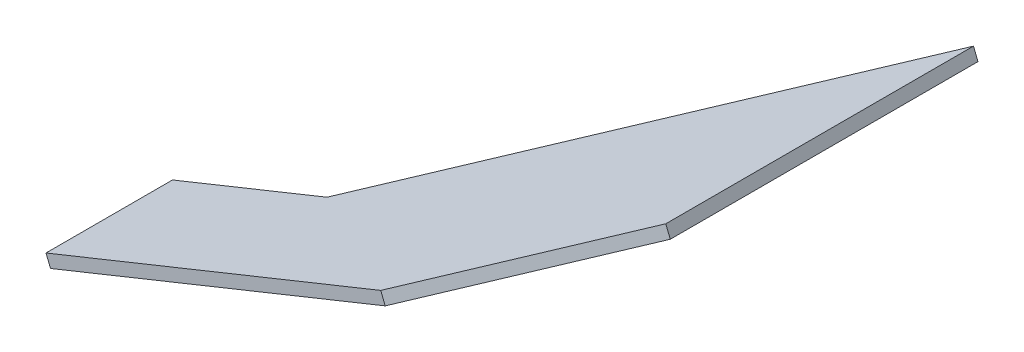
ISO-10303-21;
HEADER;
FILE_DESCRIPTION(('STEP AP214'),'2;1');
FILE_NAME('part.step','',(''),(''),'','','');
FILE_SCHEMA(('AUTOMOTIVE_DESIGN { 1 0 10303 214 1 1 1 1 }'));
ENDSEC;
DATA;
#1=APPLICATION_CONTEXT('core data for automotive mechanical design processes');
#2=APPLICATION_PROTOCOL_DEFINITION('international standard','automotive_design',2000,#1);
#3=PRODUCT_CONTEXT('',#1,'mechanical');
#4=PRODUCT('Part','Part','',(#3));
#5=PRODUCT_RELATED_PRODUCT_CATEGORY('part','',(#4));
#6=PRODUCT_DEFINITION_FORMATION('','',#4);
#7=PRODUCT_DEFINITION_CONTEXT('part definition',#1,'design');
#8=PRODUCT_DEFINITION('design','',#6,#7);
#9=PRODUCT_DEFINITION_SHAPE('','',#8);
#10=(LENGTH_UNIT() NAMED_UNIT(*) SI_UNIT(.MILLI.,.METRE.));
#11=(NAMED_UNIT(*) PLANE_ANGLE_UNIT() SI_UNIT($,.RADIAN.));
#12=(NAMED_UNIT(*) SI_UNIT($,.STERADIAN.) SOLID_ANGLE_UNIT());
#13=UNCERTAINTY_MEASURE_WITH_UNIT(LENGTH_MEASURE(1.E-05),#10,'distance_accuracy_value','');
#14=(GEOMETRIC_REPRESENTATION_CONTEXT(3) GLOBAL_UNCERTAINTY_ASSIGNED_CONTEXT((#13)) GLOBAL_UNIT_ASSIGNED_CONTEXT((#10,
#11,#12)) REPRESENTATION_CONTEXT('',''));
#15=CARTESIAN_POINT('',(0.,0.,0.));
#16=DIRECTION('',(0.,0.,1.));
#17=DIRECTION('',(1.,0.,0.));
#18=AXIS2_PLACEMENT_3D('',#15,#16,#17);
#19=CARTESIAN_POINT('',(6651.01669834428,2546.04703957658,-5519.0619892434));
#20=DIRECTION('',(-3.1513644463942E-11,7.53325970260671E-11,-1.));
#21=DIRECTION('',(0.,1.,7.53325970260671E-11));
#22=AXIS2_PLACEMENT_3D('',#19,#20,#21);
#23=PLANE('',#22);
#24=DIRECTION('',(-0.927453921512785,-0.373937459303767,1.05777320456058E-12));
#25=VECTOR('',#24,1.);
#26=CARTESIAN_POINT('',(6649.89488596637,2548.82940134112,-5519.06198924316));
#27=LINE('',#26,#25);
#28=CARTESIAN_POINT('',(6649.89488596637,2548.82940134112,-5519.06198924316));
#29=VERTEX_POINT('',#28);
#30=CARTESIAN_POINT('',(6566.56826418785,2515.23318214631,-5519.06198924306));
#31=VERTEX_POINT('',#30);
#32=EDGE_CURVE('E117',#29,#31,#27,.T.);
#33=ORIENTED_EDGE('',*,*,#32,.T.);
#34=DIRECTION('',(-0.373937459303764,0.927453921512786,8.1651644673817E-11));
#35=VECTOR('',#34,1.);
#36=CARTESIAN_POINT('',(6567.69007656576,2512.45082038177,-5519.06198924331));
#37=LINE('',#36,#35);
#38=CARTESIAN_POINT('',(6567.69007656576,2512.45082038177,-5519.06198924331));
#39=VERTEX_POINT('',#38);
#40=EDGE_CURVE('E11',#39,#31,#37,.T.);
#41=ORIENTED_EDGE('',*,*,#40,.F.);
#42=DIRECTION('',(-0.927453921512785,-0.373937459303767,1.05777320456058E-12));
#43=VECTOR('',#42,1.);
#44=CARTESIAN_POINT('',(6651.01669834428,2546.04703957658,-5519.0619892434));
#45=LINE('',#44,#43);
#46=CARTESIAN_POINT('',(6651.01669834428,2546.04703957658,-5519.0619892434));
#47=VERTEX_POINT('',#46);
#48=EDGE_CURVE('E127',#47,#39,#45,.T.);
#49=ORIENTED_EDGE('',*,*,#48,.F.);
#50=DIRECTION('',(-0.373937459303764,0.927453921512786,8.1651644673817E-11));
#51=VECTOR('',#50,1.);
#52=CARTESIAN_POINT('',(6651.01669834428,2546.04703957658,-5519.0619892434));
#53=LINE('',#52,#51);
#54=EDGE_CURVE('E113',#47,#29,#53,.T.);
#55=ORIENTED_EDGE('',*,*,#54,.T.);
#56=EDGE_LOOP('',(#33,#41,#49,#55));
#57=FACE_BOUND('',#56,.T.);
#58=ADVANCED_FACE('F33',(#57),#23,.F.);
#59=CARTESIAN_POINT('',(6567.69007656576,2512.45082038177,-5519.06198924331));
#60=DIRECTION('',(0.927453921512786,0.373937459303764,-1.07477133720858E-12));
#61=DIRECTION('',(-0.373937459303764,0.927453921512786,0.));
#62=AXIS2_PLACEMENT_3D('',#59,#60,#61);
#63=PLANE('',#62);
#64=DIRECTION('',(-3.15325048168887E-11,7.53339180374863E-11,-1.));
#65=VECTOR('',#64,1.);
#66=CARTESIAN_POINT('',(6566.56826418785,2515.23318214631,-5519.06198924306));
#67=LINE('',#66,#65);
#68=CARTESIAN_POINT('',(6566.56826418686,2515.23318214868,-5550.5527787947));
#69=VERTEX_POINT('',#68);
#70=EDGE_CURVE('E120',#31,#69,#67,.T.);
#71=ORIENTED_EDGE('',*,*,#70,.T.);
#72=DIRECTION('',(-0.373937459303764,0.927453921512786,8.1651644673817E-11));
#73=VECTOR('',#72,1.);
#74=CARTESIAN_POINT('',(6567.69007656477,2512.45082038415,-5550.55277879495));
#75=LINE('',#74,#73);
#76=CARTESIAN_POINT('',(6567.69007656477,2512.45082038415,-5550.55277879495));
#77=VERTEX_POINT('',#76);
#78=EDGE_CURVE('E41',#77,#69,#75,.T.);
#79=ORIENTED_EDGE('',*,*,#78,.F.);
#80=DIRECTION('',(-3.15325048168887E-11,7.53339180374863E-11,-1.));
#81=VECTOR('',#80,1.);
#82=CARTESIAN_POINT('',(6567.69007656576,2512.45082038177,-5519.06198924331));
#83=LINE('',#82,#81);
#84=EDGE_CURVE('E86',#39,#77,#83,.T.);
#85=ORIENTED_EDGE('',*,*,#84,.F.);
#86=ORIENTED_EDGE('',*,*,#40,.T.);
#87=EDGE_LOOP('',(#71,#79,#85,#86));
#88=FACE_BOUND('',#87,.T.);
#89=ADVANCED_FACE('F151',(#88),#63,.F.);
#90=CARTESIAN_POINT('',(6567.69007656477,2512.45082038415,-5550.55277879495));
#91=DIRECTION('',(3.15060528957195E-11,-7.5335657848462E-11,1.));
#92=DIRECTION('',(0.,-1.,-7.5335657848462E-11));
#93=AXIS2_PLACEMENT_3D('',#90,#91,#92);
#94=PLANE('',#93);
#95=DIRECTION('',(0.927453921512782,0.373937459303774,-1.04958781869196E-12));
#96=VECTOR('',#95,1.);
#97=CARTESIAN_POINT('',(6566.56826418686,2515.23318214868,-5550.5527787947));
#98=LINE('',#97,#96);
#99=CARTESIAN_POINT('',(6605.02477315211,2530.7383505701,-5550.55277879475));
#100=VERTEX_POINT('',#99);
#101=EDGE_CURVE('E122',#69,#100,#98,.T.);
#102=ORIENTED_EDGE('',*,*,#101,.T.);
#103=DIRECTION('',(-0.373937459303764,0.927453921512786,8.1651644673817E-11));
#104=VECTOR('',#103,1.);
#105=CARTESIAN_POINT('',(6606.14658553002,2527.95598880556,-5550.55277879499));
#106=LINE('',#105,#104);
#107=CARTESIAN_POINT('',(6606.14658553002,2527.95598880556,-5550.55277879499));
#108=VERTEX_POINT('',#107);
#109=EDGE_CURVE('E108',#108,#100,#106,.T.);
#110=ORIENTED_EDGE('',*,*,#109,.F.);
#111=DIRECTION('',(0.927453921512782,0.373937459303774,-1.04958781869196E-12));
#112=VECTOR('',#111,1.);
#113=CARTESIAN_POINT('',(6567.69007656477,2512.45082038415,-5550.55277879495));
#114=LINE('',#113,#112);
#115=EDGE_CURVE('E99',#77,#108,#114,.T.);
#116=ORIENTED_EDGE('',*,*,#115,.F.);
#117=ORIENTED_EDGE('',*,*,#78,.T.);
#118=EDGE_LOOP('',(#102,#110,#116,#117));
#119=FACE_BOUND('',#118,.T.);
#120=ADVANCED_FACE('F133',(#119),#94,.F.);
#121=CARTESIAN_POINT('',(6606.14658553002,2527.95598880556,-5550.55277879499));
#122=DIRECTION('',(0.632522053528306,0.255024733956012,0.731353701618444));
#123=DIRECTION('',(0.75636320662849,0.,-0.654151893415182));
#124=AXIS2_PLACEMENT_3D('',#121,#122,#123);
#125=PLANE('',#124);
#126=DIRECTION('',(0.678296858558096,0.273480545087247,-0.681998360063278));
#127=VECTOR('',#126,1.);
#128=CARTESIAN_POINT('',(6605.02477315211,2530.7383505701,-5550.55277879475));
#129=LINE('',#128,#127);
#130=CARTESIAN_POINT('',(6685.28236613628,2563.09717694497,-5631.24834166996));
#131=VERTEX_POINT('',#130);
#132=EDGE_CURVE('E107',#100,#131,#129,.T.);
#133=ORIENTED_EDGE('',*,*,#132,.T.);
#134=DIRECTION('',(-0.373937459303764,0.927453921512786,8.1651644673817E-11));
#135=VECTOR('',#134,1.);
#136=CARTESIAN_POINT('',(6686.40417851419,2560.31481518043,-5631.2483416702));
#137=LINE('',#136,#135);
#138=CARTESIAN_POINT('',(6686.40417851419,2560.31481518043,-5631.2483416702));
#139=VERTEX_POINT('',#138);
#140=EDGE_CURVE('E104',#139,#131,#137,.T.);
#141=ORIENTED_EDGE('',*,*,#140,.F.);
#142=DIRECTION('',(0.678296858558096,0.273480545087247,-0.681998360063278));
#143=VECTOR('',#142,1.);
#144=CARTESIAN_POINT('',(6606.14658553002,2527.95598880556,-5550.55277879499));
#145=LINE('',#144,#143);
#146=EDGE_CURVE('E93',#108,#139,#145,.T.);
#147=ORIENTED_EDGE('',*,*,#146,.F.);
#148=ORIENTED_EDGE('',*,*,#109,.T.);
#149=EDGE_LOOP('',(#133,#141,#147,#148));
#150=FACE_BOUND('',#149,.T.);
#151=ADVANCED_FACE('F105',(#150),#125,.F.);
#152=CARTESIAN_POINT('',(6686.40417851419,2560.31481518043,-5631.2483416702));
#153=DIRECTION('',(-0.927453921512786,-0.373937459303764,1.0591030924281E-12));
#154=DIRECTION('',(0.373937459303764,-0.927453921512786,0.));
#155=AXIS2_PLACEMENT_3D('',#152,#153,#154);
#156=PLANE('',#155);
#157=DIRECTION('',(3.15128903588237E-11,-7.53271702212207E-11,1.));
#158=VECTOR('',#157,1.);
#159=CARTESIAN_POINT('',(6685.28236613628,2563.09717694497,-5631.24834166996));
#160=LINE('',#159,#158);
#161=CARTESIAN_POINT('',(6685.28236613869,2563.0971769392,-5554.64258074936));
#162=VERTEX_POINT('',#161);
#163=EDGE_CURVE('E72',#131,#162,#160,.T.);
#164=ORIENTED_EDGE('',*,*,#163,.T.);
#165=DIRECTION('',(-0.373937459303764,0.927453921512786,8.1651644673817E-11));
#166=VECTOR('',#165,1.);
#167=CARTESIAN_POINT('',(6686.4041785166,2560.31481517466,-5554.64258074961));
#168=LINE('',#167,#166);
#169=CARTESIAN_POINT('',(6686.4041785166,2560.31481517466,-5554.64258074961));
#170=VERTEX_POINT('',#169);
#171=EDGE_CURVE('E109',#170,#162,#168,.T.);
#172=ORIENTED_EDGE('',*,*,#171,.F.);
#173=DIRECTION('',(3.15128903588237E-11,-7.53271702212207E-11,1.));
#174=VECTOR('',#173,1.);
#175=CARTESIAN_POINT('',(6686.40417851419,2560.31481518043,-5631.2483416702));
#176=LINE('',#175,#174);
#177=EDGE_CURVE('E97',#139,#170,#176,.T.);
#178=ORIENTED_EDGE('',*,*,#177,.F.);
#179=ORIENTED_EDGE('',*,*,#140,.T.);
#180=EDGE_LOOP('',(#164,#172,#178,#179));
#181=FACE_BOUND('',#180,.T.);
#182=ADVANCED_FACE('F111',(#181),#156,.F.);
#183=CARTESIAN_POINT('',(6686.4041785166,2560.31481517466,-5554.64258074961));
#184=DIRECTION('',(-0.632522053528311,-0.255024733956014,-0.731353701618439));
#185=DIRECTION('',(-0.756363206628486,0.,0.654151893415187));
#186=AXIS2_PLACEMENT_3D('',#183,#184,#185);
#187=PLANE('',#186);
#188=DIRECTION('',(-0.678296858558088,-0.273480545087256,0.681998360063283));
#189=VECTOR('',#188,1.);
#190=CARTESIAN_POINT('',(6685.28236613869,2563.0971769392,-5554.64258074936));
#191=LINE('',#190,#189);
#192=EDGE_CURVE('E78',#162,#29,#191,.T.);
#193=ORIENTED_EDGE('',*,*,#192,.T.);
#194=ORIENTED_EDGE('',*,*,#54,.F.);
#195=DIRECTION('',(-0.678296858558088,-0.273480545087256,0.681998360063283));
#196=VECTOR('',#195,1.);
#197=CARTESIAN_POINT('',(6686.4041785166,2560.31481517466,-5554.64258074961));
#198=LINE('',#197,#196);
#199=EDGE_CURVE('E49',#170,#47,#198,.T.);
#200=ORIENTED_EDGE('',*,*,#199,.F.);
#201=ORIENTED_EDGE('',*,*,#171,.T.);
#202=EDGE_LOOP('',(#193,#194,#200,#201));
#203=FACE_BOUND('',#202,.T.);
#204=ADVANCED_FACE('F140',(#203),#187,.F.);
#205=CARTESIAN_POINT('',(47.0125299243288,-116.602266378282,-1.02665035713106E-08));
#206=DIRECTION('',(0.373937459303767,-0.927453921512785,-8.16599224435006E-11));
#207=DIRECTION('',(0.927453921512785,0.373937459303767,0.));
#208=AXIS2_PLACEMENT_3D('',#205,#206,#207);
#209=PLANE('',#208);
#210=ORIENTED_EDGE('',*,*,#48,.T.);
#211=ORIENTED_EDGE('',*,*,#84,.T.);
#212=ORIENTED_EDGE('',*,*,#115,.T.);
#213=ORIENTED_EDGE('',*,*,#146,.T.);
#214=ORIENTED_EDGE('',*,*,#177,.T.);
#215=ORIENTED_EDGE('',*,*,#199,.T.);
#216=EDGE_LOOP('',(#210,#211,#212,#213,#214,#215));
#217=FACE_BOUND('',#216,.T.);
#218=ADVANCED_FACE('F95',(#217),#209,.T.);
#219=CARTESIAN_POINT('',(45.8907175464175,-113.819904613744,-1.00215486372892E-08));
#220=DIRECTION('',(0.373937459303767,-0.927453921512785,-8.16599224435006E-11));
#221=DIRECTION('',(0.927453921512785,0.373937459303767,0.));
#222=AXIS2_PLACEMENT_3D('',#219,#220,#221);
#223=PLANE('',#222);
#224=ORIENTED_EDGE('',*,*,#32,.F.);
#225=ORIENTED_EDGE('',*,*,#192,.F.);
#226=ORIENTED_EDGE('',*,*,#163,.F.);
#227=ORIENTED_EDGE('',*,*,#132,.F.);
#228=ORIENTED_EDGE('',*,*,#101,.F.);
#229=ORIENTED_EDGE('',*,*,#70,.F.);
#230=EDGE_LOOP('',(#224,#225,#226,#227,#228,#229));
#231=FACE_BOUND('',#230,.T.);
#232=ADVANCED_FACE('F136',(#231),#223,.F.);
#233=CLOSED_SHELL('',(#58,#89,#120,#151,#182,#204,#218,#232));
#234=MANIFOLD_SOLID_BREP('B2',#233);
#235=ADVANCED_BREP_SHAPE_REPRESENTATION('',(#18,#234),#14);
#236=SHAPE_DEFINITION_REPRESENTATION(#9,#235);
ENDSEC;
END-ISO-10303-21;
